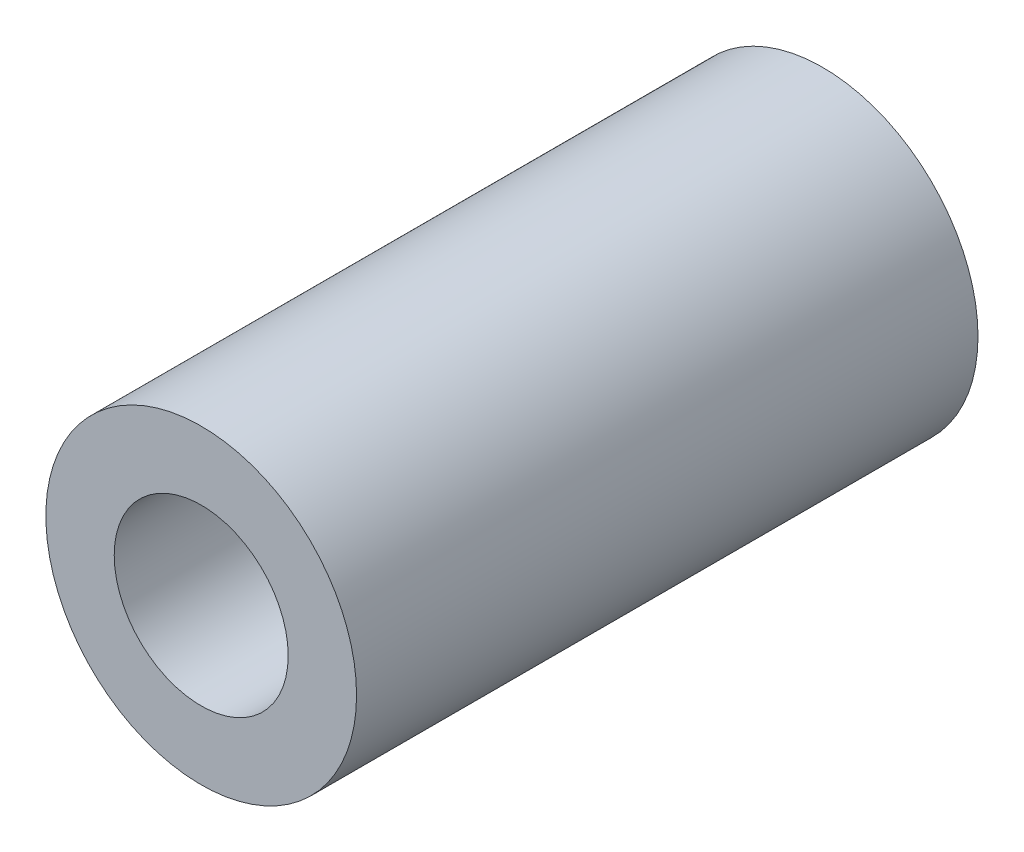
ISO-10303-21;
HEADER;
FILE_DESCRIPTION(('STEP AP214'),'2;1');
FILE_NAME('part.step','',(''),(''),'','','');
FILE_SCHEMA(('AUTOMOTIVE_DESIGN { 1 0 10303 214 1 1 1 1 }'));
ENDSEC;
DATA;
#1=APPLICATION_CONTEXT('core data for automotive mechanical design processes');
#2=APPLICATION_PROTOCOL_DEFINITION('international standard','automotive_design',2000,#1);
#3=PRODUCT_CONTEXT('',#1,'mechanical');
#4=PRODUCT('Part','Part','',(#3));
#5=PRODUCT_RELATED_PRODUCT_CATEGORY('part','',(#4));
#6=PRODUCT_DEFINITION_FORMATION('','',#4);
#7=PRODUCT_DEFINITION_CONTEXT('part definition',#1,'design');
#8=PRODUCT_DEFINITION('design','',#6,#7);
#9=PRODUCT_DEFINITION_SHAPE('','',#8);
#10=(LENGTH_UNIT() NAMED_UNIT(*) SI_UNIT(.MILLI.,.METRE.));
#11=(NAMED_UNIT(*) PLANE_ANGLE_UNIT() SI_UNIT($,.RADIAN.));
#12=(NAMED_UNIT(*) SI_UNIT($,.STERADIAN.) SOLID_ANGLE_UNIT());
#13=UNCERTAINTY_MEASURE_WITH_UNIT(LENGTH_MEASURE(1.E-05),#10,'distance_accuracy_value','');
#14=(GEOMETRIC_REPRESENTATION_CONTEXT(3) GLOBAL_UNCERTAINTY_ASSIGNED_CONTEXT((#13)) GLOBAL_UNIT_ASSIGNED_CONTEXT((#10,
#11,#12)) REPRESENTATION_CONTEXT('',''));
#15=CARTESIAN_POINT('',(0.,0.,0.));
#16=DIRECTION('',(0.,0.,1.));
#17=DIRECTION('',(1.,0.,0.));
#18=AXIS2_PLACEMENT_3D('',#15,#16,#17);
#19=CARTESIAN_POINT('',(0.,0.,6.35));
#20=DIRECTION('',(0.,0.,1.));
#21=DIRECTION('',(1.,0.,0.));
#22=AXIS2_PLACEMENT_3D('',#19,#20,#21);
#23=PLANE('',#22);
#24=CARTESIAN_POINT('',(0.,0.,6.35));
#25=DIRECTION('',(0.,0.,1.));
#26=DIRECTION('',(1.,0.,0.));
#27=AXIS2_PLACEMENT_3D('',#24,#25,#26);
#28=CIRCLE('',#27,3.175);
#29=CARTESIAN_POINT('',(3.175,0.,6.35));
#30=VERTEX_POINT('',#29);
#31=EDGE_CURVE('E10',#30,#30,#28,.T.);
#32=ORIENTED_EDGE('',*,*,#31,.T.);
#33=EDGE_LOOP('',(#32));
#34=FACE_BOUND('',#33,.T.);
#35=CARTESIAN_POINT('',(0.,0.,6.35));
#36=DIRECTION('',(0.,0.,1.));
#37=DIRECTION('',(1.,0.,0.));
#38=AXIS2_PLACEMENT_3D('',#35,#36,#37);
#39=CIRCLE('',#38,1.778);
#40=CARTESIAN_POINT('',(1.778,0.,6.35));
#41=VERTEX_POINT('',#40);
#42=EDGE_CURVE('E41',#41,#41,#39,.T.);
#43=ORIENTED_EDGE('',*,*,#42,.F.);
#44=EDGE_LOOP('',(#43));
#45=FACE_BOUND('',#44,.T.);
#46=ADVANCED_FACE('F30',(#34,#45),#23,.T.);
#47=CARTESIAN_POINT('',(0.,0.,-6.35));
#48=DIRECTION('',(0.,0.,1.));
#49=DIRECTION('',(1.,0.,0.));
#50=AXIS2_PLACEMENT_3D('',#47,#48,#49);
#51=PLANE('',#50);
#52=CARTESIAN_POINT('',(0.,0.,-6.35));
#53=DIRECTION('',(0.,0.,1.));
#54=DIRECTION('',(1.,0.,0.));
#55=AXIS2_PLACEMENT_3D('',#52,#53,#54);
#56=CIRCLE('',#55,3.175);
#57=CARTESIAN_POINT('',(3.175,0.,-6.35));
#58=VERTEX_POINT('',#57);
#59=EDGE_CURVE('E34',#58,#58,#56,.T.);
#60=ORIENTED_EDGE('',*,*,#59,.F.);
#61=EDGE_LOOP('',(#60));
#62=FACE_BOUND('',#61,.T.);
#63=CARTESIAN_POINT('',(0.,0.,-6.35));
#64=DIRECTION('',(0.,0.,1.));
#65=DIRECTION('',(1.,0.,0.));
#66=AXIS2_PLACEMENT_3D('',#63,#64,#65);
#67=CIRCLE('',#66,1.778);
#68=CARTESIAN_POINT('',(1.778,0.,-6.35));
#69=VERTEX_POINT('',#68);
#70=EDGE_CURVE('E43',#69,#69,#67,.T.);
#71=ORIENTED_EDGE('',*,*,#70,.T.);
#72=EDGE_LOOP('',(#71));
#73=FACE_BOUND('',#72,.T.);
#74=ADVANCED_FACE('F53',(#62,#73),#51,.F.);
#75=CARTESIAN_POINT('',(0.,0.,6.35));
#76=DIRECTION('',(0.,0.,-1.));
#77=DIRECTION('',(-1.,0.,0.));
#78=AXIS2_PLACEMENT_3D('',#75,#76,#77);
#79=CYLINDRICAL_SURFACE('',#78,3.175);
#80=ORIENTED_EDGE('',*,*,#31,.F.);
#81=EDGE_LOOP('',(#80));
#82=FACE_BOUND('',#81,.T.);
#83=ORIENTED_EDGE('',*,*,#59,.T.);
#84=EDGE_LOOP('',(#83));
#85=FACE_BOUND('',#84,.T.);
#86=ADVANCED_FACE('F32',(#82,#85),#79,.T.);
#87=CARTESIAN_POINT('',(0.,0.,6.35));
#88=DIRECTION('',(0.,0.,-1.));
#89=DIRECTION('',(-1.,0.,0.));
#90=AXIS2_PLACEMENT_3D('',#87,#88,#89);
#91=CYLINDRICAL_SURFACE('',#90,1.778);
#92=ORIENTED_EDGE('',*,*,#42,.T.);
#93=EDGE_LOOP('',(#92));
#94=FACE_BOUND('',#93,.T.);
#95=ORIENTED_EDGE('',*,*,#70,.F.);
#96=EDGE_LOOP('',(#95));
#97=FACE_BOUND('',#96,.T.);
#98=ADVANCED_FACE('F49',(#94,#97),#91,.F.);
#99=CLOSED_SHELL('',(#46,#74,#86,#98));
#100=MANIFOLD_SOLID_BREP('B2',#99);
#101=ADVANCED_BREP_SHAPE_REPRESENTATION('',(#18,#100),#14);
#102=SHAPE_DEFINITION_REPRESENTATION(#9,#101);
ENDSEC;
END-ISO-10303-21;
